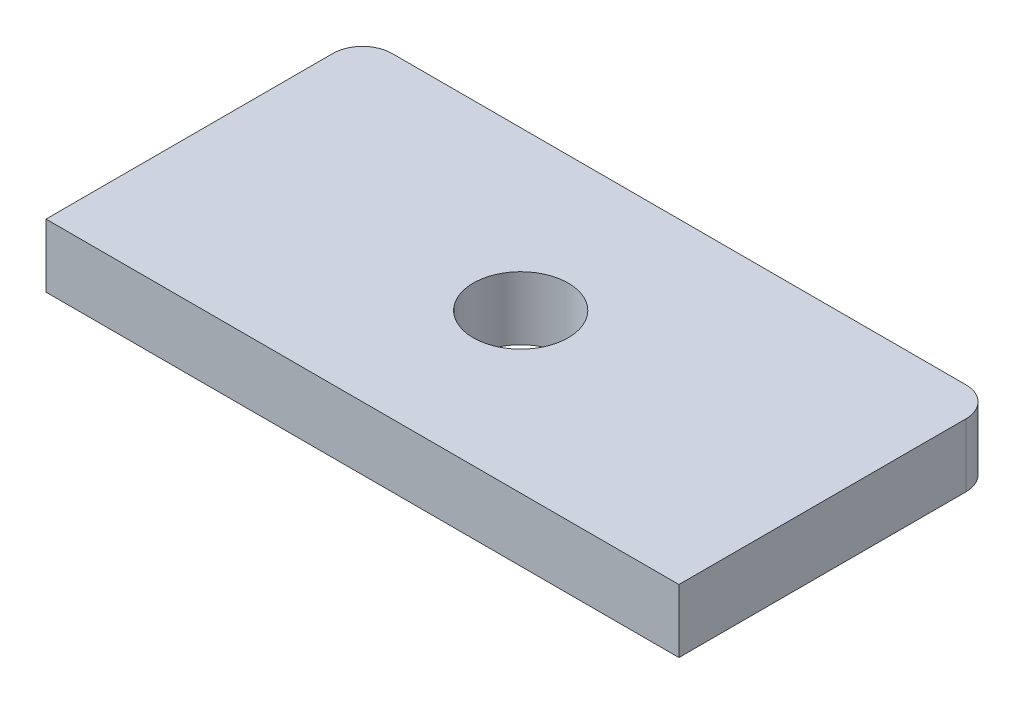
ISO-10303-21;
HEADER;
FILE_DESCRIPTION(('STEP AP214'),'2;1');
FILE_NAME('part.step','',(''),(''),'','','');
FILE_SCHEMA(('AUTOMOTIVE_DESIGN { 1 0 10303 214 1 1 1 1 }'));
ENDSEC;
DATA;
#1=APPLICATION_CONTEXT('core data for automotive mechanical design processes');
#2=APPLICATION_PROTOCOL_DEFINITION('international standard','automotive_design',2000,#1);
#3=PRODUCT_CONTEXT('',#1,'mechanical');
#4=PRODUCT('Part','Part','',(#3));
#5=PRODUCT_RELATED_PRODUCT_CATEGORY('part','',(#4));
#6=PRODUCT_DEFINITION_FORMATION('','',#4);
#7=PRODUCT_DEFINITION_CONTEXT('part definition',#1,'design');
#8=PRODUCT_DEFINITION('design','',#6,#7);
#9=PRODUCT_DEFINITION_SHAPE('','',#8);
#10=(LENGTH_UNIT() NAMED_UNIT(*) SI_UNIT(.MILLI.,.METRE.));
#11=(NAMED_UNIT(*) PLANE_ANGLE_UNIT() SI_UNIT($,.RADIAN.));
#12=(NAMED_UNIT(*) SI_UNIT($,.STERADIAN.) SOLID_ANGLE_UNIT());
#13=UNCERTAINTY_MEASURE_WITH_UNIT(LENGTH_MEASURE(1.E-05),#10,'distance_accuracy_value','');
#14=(GEOMETRIC_REPRESENTATION_CONTEXT(3) GLOBAL_UNCERTAINTY_ASSIGNED_CONTEXT((#13)) GLOBAL_UNIT_ASSIGNED_CONTEXT((#10,
#11,#12)) REPRESENTATION_CONTEXT('',''));
#15=CARTESIAN_POINT('',(0.,0.,0.));
#16=DIRECTION('',(0.,0.,1.));
#17=DIRECTION('',(1.,0.,0.));
#18=AXIS2_PLACEMENT_3D('',#15,#16,#17);
#19=CARTESIAN_POINT('',(-40.,-8.,20.));
#20=DIRECTION('',(-1.,0.,0.));
#21=DIRECTION('',(0.,0.,1.));
#22=AXIS2_PLACEMENT_3D('',#19,#20,#21);
#23=PLANE('',#22);
#24=DIRECTION('',(0.,0.,1.));
#25=VECTOR('',#24,1.);
#26=CARTESIAN_POINT('',(-40.,0.,20.));
#27=LINE('',#26,#25);
#28=CARTESIAN_POINT('',(-40.,0.,-16.26));
#29=VERTEX_POINT('',#28);
#30=CARTESIAN_POINT('',(-40.,0.,20.));
#31=VERTEX_POINT('',#30);
#32=EDGE_CURVE('E127',#29,#31,#27,.T.);
#33=ORIENTED_EDGE('',*,*,#32,.F.);
#34=DIRECTION('',(0.,1.,0.));
#35=VECTOR('',#34,1.);
#36=CARTESIAN_POINT('',(-40.,-8.,-16.26));
#37=LINE('',#36,#35);
#38=CARTESIAN_POINT('',(-40.,-8.,-16.26));
#39=VERTEX_POINT('',#38);
#40=EDGE_CURVE('E11',#29,#39,#37,.F.);
#41=ORIENTED_EDGE('',*,*,#40,.T.);
#42=DIRECTION('',(0.,0.,1.));
#43=VECTOR('',#42,1.);
#44=CARTESIAN_POINT('',(-40.,-8.,20.));
#45=LINE('',#44,#43);
#46=CARTESIAN_POINT('',(-40.,-8.,20.));
#47=VERTEX_POINT('',#46);
#48=EDGE_CURVE('E94',#39,#47,#45,.T.);
#49=ORIENTED_EDGE('',*,*,#48,.T.);
#50=DIRECTION('',(0.,1.,0.));
#51=VECTOR('',#50,1.);
#52=CARTESIAN_POINT('',(-40.,-8.,20.));
#53=LINE('',#52,#51);
#54=EDGE_CURVE('E96',#47,#31,#53,.T.);
#55=ORIENTED_EDGE('',*,*,#54,.T.);
#56=EDGE_LOOP('',(#33,#41,#49,#55));
#57=FACE_BOUND('',#56,.T.);
#58=ADVANCED_FACE('F42',(#57),#23,.T.);
#59=CARTESIAN_POINT('',(40.,-8.,-20.));
#60=DIRECTION('',(0.,0.,-1.));
#61=DIRECTION('',(-1.,0.,0.));
#62=AXIS2_PLACEMENT_3D('',#59,#60,#61);
#63=PLANE('',#62);
#64=DIRECTION('',(-1.,0.,0.));
#65=VECTOR('',#64,1.);
#66=CARTESIAN_POINT('',(40.,0.,-20.));
#67=LINE('',#66,#65);
#68=CARTESIAN_POINT('',(36.26,0.,-20.));
#69=VERTEX_POINT('',#68);
#70=CARTESIAN_POINT('',(-36.26,0.,-20.));
#71=VERTEX_POINT('',#70);
#72=EDGE_CURVE('E101',#69,#71,#67,.T.);
#73=ORIENTED_EDGE('',*,*,#72,.F.);
#74=DIRECTION('',(0.,1.,0.));
#75=VECTOR('',#74,1.);
#76=CARTESIAN_POINT('',(36.26,-8.,-20.));
#77=LINE('',#76,#75);
#78=CARTESIAN_POINT('',(36.26,-8.,-20.));
#79=VERTEX_POINT('',#78);
#80=EDGE_CURVE('E155',#69,#79,#77,.F.);
#81=ORIENTED_EDGE('',*,*,#80,.T.);
#82=DIRECTION('',(-1.,0.,0.));
#83=VECTOR('',#82,1.);
#84=CARTESIAN_POINT('',(40.,-8.,-20.));
#85=LINE('',#84,#83);
#86=CARTESIAN_POINT('',(-36.26,-8.,-20.));
#87=VERTEX_POINT('',#86);
#88=EDGE_CURVE('E110',#79,#87,#85,.T.);
#89=ORIENTED_EDGE('',*,*,#88,.T.);
#90=DIRECTION('',(0.,1.,0.));
#91=VECTOR('',#90,1.);
#92=CARTESIAN_POINT('',(-36.26,-8.,-20.));
#93=LINE('',#92,#91);
#94=EDGE_CURVE('E151',#87,#71,#93,.T.);
#95=ORIENTED_EDGE('',*,*,#94,.T.);
#96=EDGE_LOOP('',(#73,#81,#89,#95));
#97=FACE_BOUND('',#96,.T.);
#98=ADVANCED_FACE('F173',(#97),#63,.T.);
#99=CARTESIAN_POINT('',(40.,-8.,20.));
#100=DIRECTION('',(1.,0.,0.));
#101=DIRECTION('',(0.,0.,-1.));
#102=AXIS2_PLACEMENT_3D('',#99,#100,#101);
#103=PLANE('',#102);
#104=DIRECTION('',(0.,0.,-1.));
#105=VECTOR('',#104,1.);
#106=CARTESIAN_POINT('',(40.,-8.,20.));
#107=LINE('',#106,#105);
#108=CARTESIAN_POINT('',(40.,-8.,20.));
#109=VERTEX_POINT('',#108);
#110=CARTESIAN_POINT('',(40.,-8.,-16.26));
#111=VERTEX_POINT('',#110);
#112=EDGE_CURVE('E115',#109,#111,#107,.T.);
#113=ORIENTED_EDGE('',*,*,#112,.T.);
#114=DIRECTION('',(0.,1.,0.));
#115=VECTOR('',#114,1.);
#116=CARTESIAN_POINT('',(40.,-8.,-16.26));
#117=LINE('',#116,#115);
#118=CARTESIAN_POINT('',(40.,0.,-16.26));
#119=VERTEX_POINT('',#118);
#120=EDGE_CURVE('E140',#111,#119,#117,.T.);
#121=ORIENTED_EDGE('',*,*,#120,.T.);
#122=DIRECTION('',(0.,0.,-1.));
#123=VECTOR('',#122,1.);
#124=CARTESIAN_POINT('',(40.,0.,20.));
#125=LINE('',#124,#123);
#126=CARTESIAN_POINT('',(40.,0.,20.));
#127=VERTEX_POINT('',#126);
#128=EDGE_CURVE('E132',#127,#119,#125,.T.);
#129=ORIENTED_EDGE('',*,*,#128,.F.);
#130=DIRECTION('',(0.,1.,0.));
#131=VECTOR('',#130,1.);
#132=CARTESIAN_POINT('',(40.,-8.,20.));
#133=LINE('',#132,#131);
#134=EDGE_CURVE('E109',#109,#127,#133,.T.);
#135=ORIENTED_EDGE('',*,*,#134,.F.);
#136=EDGE_LOOP('',(#113,#121,#129,#135));
#137=FACE_BOUND('',#136,.T.);
#138=ADVANCED_FACE('F166',(#137),#103,.T.);
#139=CARTESIAN_POINT('',(40.,-8.,20.));
#140=DIRECTION('',(0.,0.,1.));
#141=DIRECTION('',(1.,0.,0.));
#142=AXIS2_PLACEMENT_3D('',#139,#140,#141);
#143=PLANE('',#142);
#144=DIRECTION('',(1.,0.,0.));
#145=VECTOR('',#144,1.);
#146=CARTESIAN_POINT('',(40.,0.,20.));
#147=LINE('',#146,#145);
#148=EDGE_CURVE('E107',#31,#127,#147,.T.);
#149=ORIENTED_EDGE('',*,*,#148,.F.);
#150=ORIENTED_EDGE('',*,*,#54,.F.);
#151=DIRECTION('',(1.,0.,0.));
#152=VECTOR('',#151,1.);
#153=CARTESIAN_POINT('',(40.,-8.,20.));
#154=LINE('',#153,#152);
#155=EDGE_CURVE('E100',#47,#109,#154,.T.);
#156=ORIENTED_EDGE('',*,*,#155,.T.);
#157=ORIENTED_EDGE('',*,*,#134,.T.);
#158=EDGE_LOOP('',(#149,#150,#156,#157));
#159=FACE_BOUND('',#158,.T.);
#160=ADVANCED_FACE('F105',(#159),#143,.T.);
#161=CARTESIAN_POINT('',(0.,-8.,0.));
#162=DIRECTION('',(0.,1.,0.));
#163=DIRECTION('',(0.,0.,1.));
#164=AXIS2_PLACEMENT_3D('',#161,#162,#163);
#165=PLANE('',#164);
#166=CARTESIAN_POINT('',(0.,-8.,0.));
#167=DIRECTION('',(0.,1.,0.));
#168=DIRECTION('',(0.,0.,1.));
#169=AXIS2_PLACEMENT_3D('',#166,#167,#168);
#170=CIRCLE('',#169,6.);
#171=CARTESIAN_POINT('',(0.,-8.,6.));
#172=VERTEX_POINT('',#171);
#173=EDGE_CURVE('E130',#172,#172,#170,.T.);
#174=ORIENTED_EDGE('',*,*,#173,.T.);
#175=EDGE_LOOP('',(#174));
#176=FACE_BOUND('',#175,.T.);
#177=ORIENTED_EDGE('',*,*,#88,.F.);
#178=CARTESIAN_POINT('',(36.26,-8.,-16.26));
#179=DIRECTION('',(0.,1.,0.));
#180=DIRECTION('',(0.,0.,1.));
#181=AXIS2_PLACEMENT_3D('',#178,#179,#180);
#182=CIRCLE('',#181,3.74);
#183=EDGE_CURVE('E51',#79,#111,#182,.F.);
#184=ORIENTED_EDGE('',*,*,#183,.T.);
#185=ORIENTED_EDGE('',*,*,#112,.F.);
#186=ORIENTED_EDGE('',*,*,#155,.F.);
#187=ORIENTED_EDGE('',*,*,#48,.F.);
#188=CARTESIAN_POINT('',(-36.26,-8.,-16.26));
#189=DIRECTION('',(0.,1.,0.));
#190=DIRECTION('',(0.,0.,1.));
#191=AXIS2_PLACEMENT_3D('',#188,#189,#190);
#192=CIRCLE('',#191,3.74);
#193=EDGE_CURVE('E63',#39,#87,#192,.F.);
#194=ORIENTED_EDGE('',*,*,#193,.T.);
#195=EDGE_LOOP('',(#177,#184,#185,#186,#187,#194));
#196=FACE_BOUND('',#195,.T.);
#197=ADVANCED_FACE('F113',(#176,#196),#165,.F.);
#198=CARTESIAN_POINT('',(0.,0.,0.));
#199=DIRECTION('',(0.,1.,0.));
#200=DIRECTION('',(0.,0.,1.));
#201=AXIS2_PLACEMENT_3D('',#198,#199,#200);
#202=PLANE('',#201);
#203=CARTESIAN_POINT('',(0.,0.,0.));
#204=DIRECTION('',(0.,1.,0.));
#205=DIRECTION('',(0.,0.,1.));
#206=AXIS2_PLACEMENT_3D('',#203,#204,#205);
#207=CIRCLE('',#206,6.);
#208=CARTESIAN_POINT('',(0.,0.,6.));
#209=VERTEX_POINT('',#208);
#210=EDGE_CURVE('E207',#209,#209,#207,.T.);
#211=ORIENTED_EDGE('',*,*,#210,.F.);
#212=EDGE_LOOP('',(#211));
#213=FACE_BOUND('',#212,.T.);
#214=ORIENTED_EDGE('',*,*,#128,.T.);
#215=CARTESIAN_POINT('',(36.26,0.,-16.26));
#216=DIRECTION('',(0.,1.,0.));
#217=DIRECTION('',(0.,0.,1.));
#218=AXIS2_PLACEMENT_3D('',#215,#216,#217);
#219=CIRCLE('',#218,3.74);
#220=EDGE_CURVE('E148',#119,#69,#219,.T.);
#221=ORIENTED_EDGE('',*,*,#220,.T.);
#222=ORIENTED_EDGE('',*,*,#72,.T.);
#223=CARTESIAN_POINT('',(-36.26,0.,-16.26));
#224=DIRECTION('',(0.,1.,0.));
#225=DIRECTION('',(0.,0.,1.));
#226=AXIS2_PLACEMENT_3D('',#223,#224,#225);
#227=CIRCLE('',#226,3.74);
#228=EDGE_CURVE('E145',#71,#29,#227,.T.);
#229=ORIENTED_EDGE('',*,*,#228,.T.);
#230=ORIENTED_EDGE('',*,*,#32,.T.);
#231=ORIENTED_EDGE('',*,*,#148,.T.);
#232=EDGE_LOOP('',(#214,#221,#222,#229,#230,#231));
#233=FACE_BOUND('',#232,.T.);
#234=ADVANCED_FACE('F171',(#213,#233),#202,.T.);
#235=CARTESIAN_POINT('',(0.,-8.,0.));
#236=DIRECTION('',(0.,1.,0.));
#237=DIRECTION('',(0.,0.,1.));
#238=AXIS2_PLACEMENT_3D('',#235,#236,#237);
#239=CYLINDRICAL_SURFACE('',#238,6.);
#240=ORIENTED_EDGE('',*,*,#173,.F.);
#241=EDGE_LOOP('',(#240));
#242=FACE_BOUND('',#241,.T.);
#243=ORIENTED_EDGE('',*,*,#210,.T.);
#244=EDGE_LOOP('',(#243));
#245=FACE_BOUND('',#244,.T.);
#246=ADVANCED_FACE('F180',(#242,#245),#239,.F.);
#247=CARTESIAN_POINT('',(36.26,-8.,-16.26));
#248=DIRECTION('',(0.,1.,0.));
#249=DIRECTION('',(0.,0.,1.));
#250=AXIS2_PLACEMENT_3D('',#247,#248,#249);
#251=CYLINDRICAL_SURFACE('',#250,3.74);
#252=ORIENTED_EDGE('',*,*,#183,.F.);
#253=ORIENTED_EDGE('',*,*,#80,.F.);
#254=ORIENTED_EDGE('',*,*,#220,.F.);
#255=ORIENTED_EDGE('',*,*,#120,.F.);
#256=EDGE_LOOP('',(#252,#253,#254,#255));
#257=FACE_BOUND('',#256,.T.);
#258=ADVANCED_FACE('F168',(#257),#251,.T.);
#259=CARTESIAN_POINT('',(-36.26,-8.,-16.26));
#260=DIRECTION('',(0.,1.,0.));
#261=DIRECTION('',(0.,0.,1.));
#262=AXIS2_PLACEMENT_3D('',#259,#260,#261);
#263=CYLINDRICAL_SURFACE('',#262,3.74);
#264=ORIENTED_EDGE('',*,*,#193,.F.);
#265=ORIENTED_EDGE('',*,*,#40,.F.);
#266=ORIENTED_EDGE('',*,*,#228,.F.);
#267=ORIENTED_EDGE('',*,*,#94,.F.);
#268=EDGE_LOOP('',(#264,#265,#266,#267));
#269=FACE_BOUND('',#268,.T.);
#270=ADVANCED_FACE('F44',(#269),#263,.T.);
#271=CLOSED_SHELL('',(#58,#98,#138,#160,#197,#234,#246,#258,#270));
#272=MANIFOLD_SOLID_BREP('B2',#271);
#273=ADVANCED_BREP_SHAPE_REPRESENTATION('',(#18,#272),#14);
#274=SHAPE_DEFINITION_REPRESENTATION(#9,#273);
ENDSEC;
END-ISO-10303-21;
